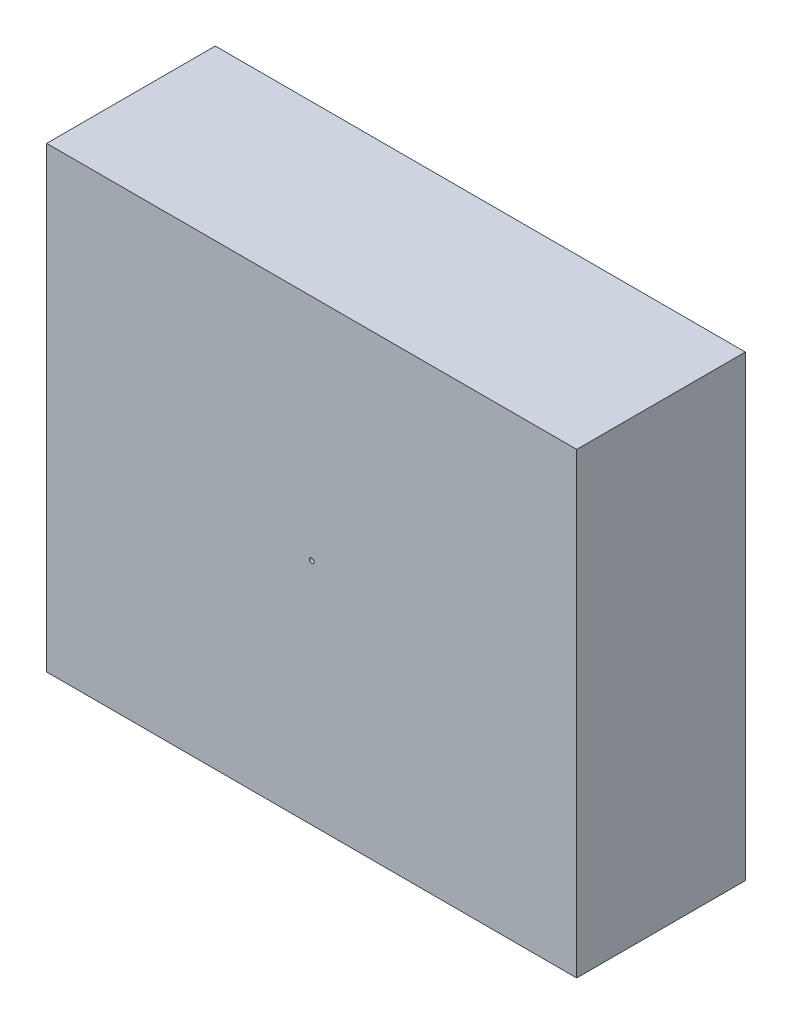
ISO-10303-21;
HEADER;
FILE_DESCRIPTION(('STEP AP214'),'2;1');
FILE_NAME('part.step','',(''),(''),'','','');
FILE_SCHEMA(('AUTOMOTIVE_DESIGN { 1 0 10303 214 1 1 1 1 }'));
ENDSEC;
DATA;
#1=APPLICATION_CONTEXT('core data for automotive mechanical design processes');
#2=APPLICATION_PROTOCOL_DEFINITION('international standard','automotive_design',2000,#1);
#3=PRODUCT_CONTEXT('',#1,'mechanical');
#4=PRODUCT('Part','Part','',(#3));
#5=PRODUCT_RELATED_PRODUCT_CATEGORY('part','',(#4));
#6=PRODUCT_DEFINITION_FORMATION('','',#4);
#7=PRODUCT_DEFINITION_CONTEXT('part definition',#1,'design');
#8=PRODUCT_DEFINITION('design','',#6,#7);
#9=PRODUCT_DEFINITION_SHAPE('','',#8);
#10=(LENGTH_UNIT() NAMED_UNIT(*) SI_UNIT(.MILLI.,.METRE.));
#11=(NAMED_UNIT(*) PLANE_ANGLE_UNIT() SI_UNIT($,.RADIAN.));
#12=(NAMED_UNIT(*) SI_UNIT($,.STERADIAN.) SOLID_ANGLE_UNIT());
#13=UNCERTAINTY_MEASURE_WITH_UNIT(LENGTH_MEASURE(1.E-05),#10,'distance_accuracy_value','');
#14=(GEOMETRIC_REPRESENTATION_CONTEXT(3) GLOBAL_UNCERTAINTY_ASSIGNED_CONTEXT((#13)) GLOBAL_UNIT_ASSIGNED_CONTEXT((#10,
#11,#12)) REPRESENTATION_CONTEXT('',''));
#15=CARTESIAN_POINT('',(0.,0.,0.));
#16=DIRECTION('',(0.,0.,1.));
#17=DIRECTION('',(1.,0.,0.));
#18=AXIS2_PLACEMENT_3D('',#15,#16,#17);
#19=CARTESIAN_POINT('',(0.,0.,70.));
#20=DIRECTION('',(-1.,0.,0.));
#21=DIRECTION('',(0.,-1.,0.));
#22=AXIS2_PLACEMENT_3D('',#19,#20,#21);
#23=PLANE('',#22);
#24=DIRECTION('',(0.,1.,0.));
#25=VECTOR('',#24,1.);
#26=CARTESIAN_POINT('',(0.,0.,0.));
#27=LINE('',#26,#25);
#28=CARTESIAN_POINT('',(0.,0.,0.));
#29=VERTEX_POINT('',#28);
#30=CARTESIAN_POINT('',(0.,190.,0.));
#31=VERTEX_POINT('',#30);
#32=EDGE_CURVE('E98',#29,#31,#27,.T.);
#33=ORIENTED_EDGE('',*,*,#32,.T.);
#34=DIRECTION('',(0.,0.,-1.));
#35=VECTOR('',#34,1.);
#36=CARTESIAN_POINT('',(0.,190.,70.));
#37=LINE('',#36,#35);
#38=CARTESIAN_POINT('',(0.,190.,70.));
#39=VERTEX_POINT('',#38);
#40=EDGE_CURVE('E11',#39,#31,#37,.T.);
#41=ORIENTED_EDGE('',*,*,#40,.F.);
#42=DIRECTION('',(0.,1.,0.));
#43=VECTOR('',#42,1.);
#44=CARTESIAN_POINT('',(0.,0.,70.));
#45=LINE('',#44,#43);
#46=CARTESIAN_POINT('',(0.,0.,70.));
#47=VERTEX_POINT('',#46);
#48=EDGE_CURVE('E85',#47,#39,#45,.T.);
#49=ORIENTED_EDGE('',*,*,#48,.F.);
#50=DIRECTION('',(0.,0.,-1.));
#51=VECTOR('',#50,1.);
#52=CARTESIAN_POINT('',(0.,0.,70.));
#53=LINE('',#52,#51);
#54=EDGE_CURVE('E94',#47,#29,#53,.T.);
#55=ORIENTED_EDGE('',*,*,#54,.T.);
#56=EDGE_LOOP('',(#33,#41,#49,#55));
#57=FACE_BOUND('',#56,.T.);
#58=ADVANCED_FACE('F33',(#57),#23,.F.);
#59=CARTESIAN_POINT('',(0.,190.,70.));
#60=DIRECTION('',(0.,-1.,0.));
#61=DIRECTION('',(1.,0.,0.));
#62=AXIS2_PLACEMENT_3D('',#59,#60,#61);
#63=PLANE('',#62);
#64=DIRECTION('',(-1.,0.,0.));
#65=VECTOR('',#64,1.);
#66=CARTESIAN_POINT('',(0.,190.,0.));
#67=LINE('',#66,#65);
#68=CARTESIAN_POINT('',(-220.,190.,0.));
#69=VERTEX_POINT('',#68);
#70=EDGE_CURVE('E89',#31,#69,#67,.T.);
#71=ORIENTED_EDGE('',*,*,#70,.T.);
#72=DIRECTION('',(0.,0.,-1.));
#73=VECTOR('',#72,1.);
#74=CARTESIAN_POINT('',(-220.,190.,70.));
#75=LINE('',#74,#73);
#76=CARTESIAN_POINT('',(-220.,190.,70.));
#77=VERTEX_POINT('',#76);
#78=EDGE_CURVE('E42',#77,#69,#75,.T.);
#79=ORIENTED_EDGE('',*,*,#78,.F.);
#80=DIRECTION('',(-1.,0.,0.));
#81=VECTOR('',#80,1.);
#82=CARTESIAN_POINT('',(0.,190.,70.));
#83=LINE('',#82,#81);
#84=EDGE_CURVE('E80',#39,#77,#83,.T.);
#85=ORIENTED_EDGE('',*,*,#84,.F.);
#86=ORIENTED_EDGE('',*,*,#40,.T.);
#87=EDGE_LOOP('',(#71,#79,#85,#86));
#88=FACE_BOUND('',#87,.T.);
#89=ADVANCED_FACE('F88',(#88),#63,.F.);
#90=CARTESIAN_POINT('',(-220.,0.,70.));
#91=DIRECTION('',(1.,0.,0.));
#92=DIRECTION('',(0.,0.,-1.));
#93=AXIS2_PLACEMENT_3D('',#90,#91,#92);
#94=PLANE('',#93);
#95=DIRECTION('',(0.,-1.,0.));
#96=VECTOR('',#95,1.);
#97=CARTESIAN_POINT('',(-220.,0.,0.));
#98=LINE('',#97,#96);
#99=CARTESIAN_POINT('',(-220.,0.,0.));
#100=VERTEX_POINT('',#99);
#101=EDGE_CURVE('E67',#69,#100,#98,.T.);
#102=ORIENTED_EDGE('',*,*,#101,.T.);
#103=DIRECTION('',(0.,0.,-1.));
#104=VECTOR('',#103,1.);
#105=CARTESIAN_POINT('',(-220.,0.,70.));
#106=LINE('',#105,#104);
#107=CARTESIAN_POINT('',(-220.,0.,70.));
#108=VERTEX_POINT('',#107);
#109=EDGE_CURVE('E90',#108,#100,#106,.T.);
#110=ORIENTED_EDGE('',*,*,#109,.F.);
#111=DIRECTION('',(0.,-1.,0.));
#112=VECTOR('',#111,1.);
#113=CARTESIAN_POINT('',(-220.,0.,70.));
#114=LINE('',#113,#112);
#115=EDGE_CURVE('E83',#77,#108,#114,.T.);
#116=ORIENTED_EDGE('',*,*,#115,.F.);
#117=ORIENTED_EDGE('',*,*,#78,.T.);
#118=EDGE_LOOP('',(#102,#110,#116,#117));
#119=FACE_BOUND('',#118,.T.);
#120=ADVANCED_FACE('F92',(#119),#94,.F.);
#121=CARTESIAN_POINT('',(0.,0.,70.));
#122=DIRECTION('',(0.,1.,0.));
#123=DIRECTION('',(-1.,0.,0.));
#124=AXIS2_PLACEMENT_3D('',#121,#122,#123);
#125=PLANE('',#124);
#126=DIRECTION('',(1.,0.,0.));
#127=VECTOR('',#126,1.);
#128=CARTESIAN_POINT('',(0.,0.,0.));
#129=LINE('',#128,#127);
#130=EDGE_CURVE('E73',#100,#29,#129,.T.);
#131=ORIENTED_EDGE('',*,*,#130,.T.);
#132=ORIENTED_EDGE('',*,*,#54,.F.);
#133=DIRECTION('',(1.,0.,0.));
#134=VECTOR('',#133,1.);
#135=CARTESIAN_POINT('',(0.,0.,70.));
#136=LINE('',#135,#134);
#137=EDGE_CURVE('E50',#108,#47,#136,.T.);
#138=ORIENTED_EDGE('',*,*,#137,.F.);
#139=ORIENTED_EDGE('',*,*,#109,.T.);
#140=EDGE_LOOP('',(#131,#132,#138,#139));
#141=FACE_BOUND('',#140,.T.);
#142=ADVANCED_FACE('F106',(#141),#125,.F.);
#143=CARTESIAN_POINT('',(0.,0.,70.));
#144=DIRECTION('',(0.,0.,1.));
#145=DIRECTION('',(1.,0.,0.));
#146=AXIS2_PLACEMENT_3D('',#143,#144,#145);
#147=PLANE('',#146);
#148=CARTESIAN_POINT('',(-110.,95.,70.));
#149=DIRECTION('',(0.,0.,1.));
#150=DIRECTION('',(1.,0.,0.));
#151=AXIS2_PLACEMENT_3D('',#148,#149,#150);
#152=CIRCLE('',#151,0.999999999999998);
#153=CARTESIAN_POINT('',(-109.,95.,70.));
#154=VERTEX_POINT('',#153);
#155=EDGE_CURVE('E101',#154,#154,#152,.T.);
#156=ORIENTED_EDGE('',*,*,#155,.F.);
#157=EDGE_LOOP('',(#156));
#158=FACE_BOUND('',#157,.T.);
#159=ORIENTED_EDGE('',*,*,#48,.T.);
#160=ORIENTED_EDGE('',*,*,#84,.T.);
#161=ORIENTED_EDGE('',*,*,#115,.T.);
#162=ORIENTED_EDGE('',*,*,#137,.T.);
#163=EDGE_LOOP('',(#159,#160,#161,#162));
#164=FACE_BOUND('',#163,.T.);
#165=ADVANCED_FACE('F81',(#158,#164),#147,.T.);
#166=CARTESIAN_POINT('',(0.,0.,0.));
#167=DIRECTION('',(0.,0.,1.));
#168=DIRECTION('',(1.,0.,0.));
#169=AXIS2_PLACEMENT_3D('',#166,#167,#168);
#170=PLANE('',#169);
#171=CARTESIAN_POINT('',(-110.,95.,0.));
#172=DIRECTION('',(0.,0.,1.));
#173=DIRECTION('',(1.,0.,0.));
#174=AXIS2_PLACEMENT_3D('',#171,#172,#173);
#175=CIRCLE('',#174,0.999999999999998);
#176=CARTESIAN_POINT('',(-109.,95.,0.));
#177=VERTEX_POINT('',#176);
#178=EDGE_CURVE('E36',#177,#177,#175,.T.);
#179=ORIENTED_EDGE('',*,*,#178,.T.);
#180=EDGE_LOOP('',(#179));
#181=FACE_BOUND('',#180,.T.);
#182=ORIENTED_EDGE('',*,*,#32,.F.);
#183=ORIENTED_EDGE('',*,*,#130,.F.);
#184=ORIENTED_EDGE('',*,*,#101,.F.);
#185=ORIENTED_EDGE('',*,*,#70,.F.);
#186=EDGE_LOOP('',(#182,#183,#184,#185));
#187=FACE_BOUND('',#186,.T.);
#188=ADVANCED_FACE('F109',(#181,#187),#170,.F.);
#189=CARTESIAN_POINT('',(-110.,95.,119.));
#190=DIRECTION('',(0.,0.,-1.));
#191=DIRECTION('',(-1.,0.,0.));
#192=AXIS2_PLACEMENT_3D('',#189,#190,#191);
#193=CYLINDRICAL_SURFACE('',#192,0.999999999999998);
#194=ORIENTED_EDGE('',*,*,#155,.T.);
#195=EDGE_LOOP('',(#194));
#196=FACE_BOUND('',#195,.T.);
#197=ORIENTED_EDGE('',*,*,#178,.F.);
#198=EDGE_LOOP('',(#197));
#199=FACE_BOUND('',#198,.T.);
#200=ADVANCED_FACE('F119',(#196,#199),#193,.F.);
#201=CLOSED_SHELL('',(#58,#89,#120,#142,#165,#188,#200));
#202=MANIFOLD_SOLID_BREP('B2',#201);
#203=ADVANCED_BREP_SHAPE_REPRESENTATION('',(#18,#202),#14);
#204=SHAPE_DEFINITION_REPRESENTATION(#9,#203);
ENDSEC;
END-ISO-10303-21;
